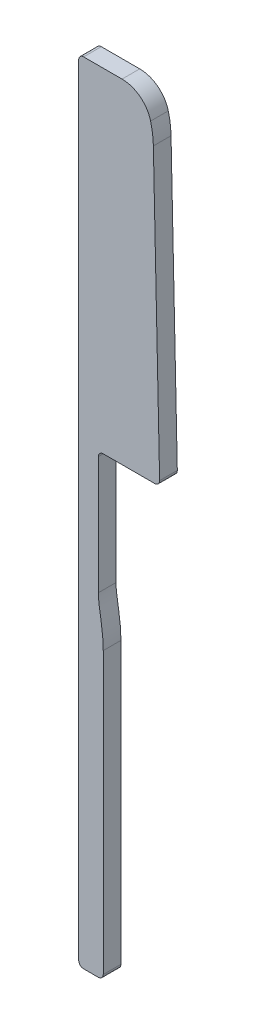
ISO-10303-21;
HEADER;
FILE_DESCRIPTION(('STEP AP214'),'2;1');
FILE_NAME('part.step','',(''),(''),'','','');
FILE_SCHEMA(('AUTOMOTIVE_DESIGN { 1 0 10303 214 1 1 1 1 }'));
ENDSEC;
DATA;
#1=APPLICATION_CONTEXT('core data for automotive mechanical design processes');
#2=APPLICATION_PROTOCOL_DEFINITION('international standard','automotive_design',2000,#1);
#3=PRODUCT_CONTEXT('',#1,'mechanical');
#4=PRODUCT('Part','Part','',(#3));
#5=PRODUCT_RELATED_PRODUCT_CATEGORY('part','',(#4));
#6=PRODUCT_DEFINITION_FORMATION('','',#4);
#7=PRODUCT_DEFINITION_CONTEXT('part definition',#1,'design');
#8=PRODUCT_DEFINITION('design','',#6,#7);
#9=PRODUCT_DEFINITION_SHAPE('','',#8);
#10=(LENGTH_UNIT() NAMED_UNIT(*) SI_UNIT(.MILLI.,.METRE.));
#11=(NAMED_UNIT(*) PLANE_ANGLE_UNIT() SI_UNIT($,.RADIAN.));
#12=(NAMED_UNIT(*) SI_UNIT($,.STERADIAN.) SOLID_ANGLE_UNIT());
#13=UNCERTAINTY_MEASURE_WITH_UNIT(LENGTH_MEASURE(1.E-05),#10,'distance_accuracy_value','');
#14=(GEOMETRIC_REPRESENTATION_CONTEXT(3) GLOBAL_UNCERTAINTY_ASSIGNED_CONTEXT((#13)) GLOBAL_UNIT_ASSIGNED_CONTEXT((#10,
#11,#12)) REPRESENTATION_CONTEXT('',''));
#15=CARTESIAN_POINT('',(0.,0.,0.));
#16=DIRECTION('',(0.,0.,1.));
#17=DIRECTION('',(1.,0.,0.));
#18=AXIS2_PLACEMENT_3D('',#15,#16,#17);
#19=CARTESIAN_POINT('',(14.4143233217841,80.5,1.8));
#20=DIRECTION('',(0.,0.,-1.));
#21=DIRECTION('',(-1.,0.,0.));
#22=AXIS2_PLACEMENT_3D('',#19,#20,#21);
#23=CYLINDRICAL_SURFACE('',#22,3.);
#24=DIRECTION('',(0.,0.,-1.));
#25=VECTOR('',#24,1.);
#26=CARTESIAN_POINT('',(17.3194338133368,81.2485539605604,1.8));
#27=LINE('',#26,#25);
#28=CARTESIAN_POINT('',(17.3194338133368,81.2485539605604,0.));
#29=VERTEX_POINT('',#28);
#30=CARTESIAN_POINT('',(17.3194338133368,81.2485539605604,1.8));
#31=VERTEX_POINT('',#30);
#32=EDGE_CURVE('E213',#29,#31,#27,.F.);
#33=ORIENTED_EDGE('',*,*,#32,.F.);
#34=CARTESIAN_POINT('',(14.4143233217841,80.5,0.));
#35=DIRECTION('',(0.,0.,-1.));
#36=DIRECTION('',(-1.,0.,0.));
#37=AXIS2_PLACEMENT_3D('',#34,#35,#36);
#38=CIRCLE('',#37,3.);
#39=CARTESIAN_POINT('',(14.4143233217841,83.5,0.));
#40=VERTEX_POINT('',#39);
#41=EDGE_CURVE('E45',#40,#29,#38,.T.);
#42=ORIENTED_EDGE('',*,*,#41,.F.);
#43=DIRECTION('',(0.,0.,-1.));
#44=VECTOR('',#43,1.);
#45=CARTESIAN_POINT('',(14.4143233217841,83.5,1.8));
#46=LINE('',#45,#44);
#47=CARTESIAN_POINT('',(14.4143233217841,83.5,1.8));
#48=VERTEX_POINT('',#47);
#49=EDGE_CURVE('E217',#48,#40,#46,.T.);
#50=ORIENTED_EDGE('',*,*,#49,.F.);
#51=CARTESIAN_POINT('',(14.4143233217841,80.5,1.8));
#52=DIRECTION('',(0.,0.,-1.));
#53=DIRECTION('',(-1.,0.,0.));
#54=AXIS2_PLACEMENT_3D('',#51,#52,#53);
#55=CIRCLE('',#54,3.);
#56=EDGE_CURVE('E11',#31,#48,#55,.F.);
#57=ORIENTED_EDGE('',*,*,#56,.F.);
#58=EDGE_LOOP('',(#33,#42,#50,#57));
#59=FACE_BOUND('',#58,.T.);
#60=ADVANCED_FACE('F38',(#59),#23,.T.);
#61=CARTESIAN_POINT('',(12.5,32.15,1.8));
#62=DIRECTION('',(-1.,0.,0.));
#63=DIRECTION('',(0.,-1.,0.));
#64=AXIS2_PLACEMENT_3D('',#61,#62,#63);
#65=PLANE('',#64);
#66=DIRECTION('',(0.,1.,0.));
#67=VECTOR('',#66,1.);
#68=CARTESIAN_POINT('',(12.5,32.15,1.8));
#69=LINE('',#68,#67);
#70=CARTESIAN_POINT('',(12.5,3.59,1.8));
#71=VERTEX_POINT('',#70);
#72=CARTESIAN_POINT('',(12.5,32.15,1.8));
#73=VERTEX_POINT('',#72);
#74=EDGE_CURVE('E139',#71,#73,#69,.T.);
#75=ORIENTED_EDGE('',*,*,#74,.F.);
#76=DIRECTION('',(0.,0.,1.));
#77=VECTOR('',#76,1.);
#78=CARTESIAN_POINT('',(12.5,3.59,0.));
#79=LINE('',#78,#77);
#80=CARTESIAN_POINT('',(12.5,3.59,0.));
#81=VERTEX_POINT('',#80);
#82=EDGE_CURVE('E278',#71,#81,#79,.F.);
#83=ORIENTED_EDGE('',*,*,#82,.T.);
#84=DIRECTION('',(0.,1.,0.));
#85=VECTOR('',#84,1.);
#86=CARTESIAN_POINT('',(12.5,32.15,0.));
#87=LINE('',#86,#85);
#88=CARTESIAN_POINT('',(12.5,32.15,0.));
#89=VERTEX_POINT('',#88);
#90=EDGE_CURVE('E156',#81,#89,#87,.T.);
#91=ORIENTED_EDGE('',*,*,#90,.T.);
#92=DIRECTION('',(0.,0.,-1.));
#93=VECTOR('',#92,1.);
#94=CARTESIAN_POINT('',(12.5,32.15,1.8));
#95=LINE('',#94,#93);
#96=EDGE_CURVE('E153',#73,#89,#95,.T.);
#97=ORIENTED_EDGE('',*,*,#96,.F.);
#98=EDGE_LOOP('',(#75,#83,#91,#97));
#99=FACE_BOUND('',#98,.T.);
#100=ADVANCED_FACE('F154',(#99),#65,.F.);
#101=CARTESIAN_POINT('',(9.61,12.5113444444444,1.8));
#102=DIRECTION('',(0.,0.,-1.));
#103=DIRECTION('',(-1.,0.,0.));
#104=AXIS2_PLACEMENT_3D('',#101,#102,#103);
#105=PLANE('',#104);
#106=CARTESIAN_POINT('',(8.60410233867879,79.0028920788793,1.8));
#107=DIRECTION('',(0.,0.,1.));
#108=DIRECTION('',(1.,0.,0.));
#109=AXIS2_PLACEMENT_3D('',#106,#107,#108);
#110=CIRCLE('',#109,9.00000000000001);
#111=CARTESIAN_POINT('',(17.601960582398,79.1992260441903,1.8));
#112=VERTEX_POINT('',#111);
#113=EDGE_CURVE('E293',#112,#31,#110,.T.);
#114=ORIENTED_EDGE('',*,*,#113,.T.);
#115=ORIENTED_EDGE('',*,*,#56,.T.);
#116=DIRECTION('',(-1.,0.,0.));
#117=VECTOR('',#116,1.);
#118=CARTESIAN_POINT('',(10.,83.5,1.8));
#119=LINE('',#118,#117);
#120=CARTESIAN_POINT('',(10.5,83.5,1.8));
#121=VERTEX_POINT('',#120);
#122=EDGE_CURVE('E292',#48,#121,#119,.T.);
#123=ORIENTED_EDGE('',*,*,#122,.T.);
#124=CARTESIAN_POINT('',(10.5,83.,1.8));
#125=DIRECTION('',(0.,0.,-1.));
#126=DIRECTION('',(-1.,0.,0.));
#127=AXIS2_PLACEMENT_3D('',#124,#125,#126);
#128=CIRCLE('',#127,0.5);
#129=CARTESIAN_POINT('',(10.,83.,1.8));
#130=VERTEX_POINT('',#129);
#131=EDGE_CURVE('E253',#121,#130,#128,.F.);
#132=ORIENTED_EDGE('',*,*,#131,.T.);
#133=DIRECTION('',(0.,-1.,0.));
#134=VECTOR('',#133,1.);
#135=CARTESIAN_POINT('',(10.,14.5,1.8));
#136=LINE('',#135,#134);
#137=CARTESIAN_POINT('',(10.,3.59,1.8));
#138=VERTEX_POINT('',#137);
#139=EDGE_CURVE('E239',#130,#138,#136,.T.);
#140=ORIENTED_EDGE('',*,*,#139,.T.);
#141=CARTESIAN_POINT('',(10.5,3.59,1.8));
#142=DIRECTION('',(0.,0.,-1.));
#143=DIRECTION('',(-1.,0.,0.));
#144=AXIS2_PLACEMENT_3D('',#141,#142,#143);
#145=CIRCLE('',#144,0.5);
#146=CARTESIAN_POINT('',(10.5,3.09,1.8));
#147=VERTEX_POINT('',#146);
#148=EDGE_CURVE('E275',#138,#147,#145,.F.);
#149=ORIENTED_EDGE('',*,*,#148,.T.);
#150=DIRECTION('',(-1.,0.,0.));
#151=VECTOR('',#150,1.);
#152=CARTESIAN_POINT('',(10.,3.09,1.8));
#153=LINE('',#152,#151);
#154=CARTESIAN_POINT('',(12.,3.09,1.8));
#155=VERTEX_POINT('',#154);
#156=EDGE_CURVE('E303',#155,#147,#153,.T.);
#157=ORIENTED_EDGE('',*,*,#156,.F.);
#158=CARTESIAN_POINT('',(12.,3.59,1.8));
#159=DIRECTION('',(0.,0.,-1.));
#160=DIRECTION('',(-1.,0.,0.));
#161=AXIS2_PLACEMENT_3D('',#158,#159,#160);
#162=CIRCLE('',#161,0.5);
#163=EDGE_CURVE('E147',#155,#71,#162,.F.);
#164=ORIENTED_EDGE('',*,*,#163,.T.);
#165=ORIENTED_EDGE('',*,*,#74,.T.);
#166=CARTESIAN_POINT('',(12.5,32.15,1.8));
#167=CARTESIAN_POINT('',(12.5,34.1534508074309,1.8));
#168=CARTESIAN_POINT('',(12.,35.7421929324208,1.8));
#169=CARTESIAN_POINT('',(12.,37.,1.8));
#170=B_SPLINE_CURVE_WITH_KNOTS('',3,(#166,#167,#168,#169),.UNSPECIFIED.,.F.,.F.,(4,4),(0.,1.),.UNSPECIFIED.);
#171=CARTESIAN_POINT('',(12.,37.,1.8));
#172=VERTEX_POINT('',#171);
#173=EDGE_CURVE('E144',#73,#172,#170,.T.);
#174=ORIENTED_EDGE('',*,*,#173,.T.);
#175=DIRECTION('',(0.,1.,0.));
#176=VECTOR('',#175,1.);
#177=CARTESIAN_POINT('',(12.,49.5,1.8));
#178=LINE('',#177,#176);
#179=CARTESIAN_POINT('',(12.,49.,1.8));
#180=VERTEX_POINT('',#179);
#181=EDGE_CURVE('E165',#172,#180,#178,.T.);
#182=ORIENTED_EDGE('',*,*,#181,.T.);
#183=CARTESIAN_POINT('',(12.5,49.,1.8));
#184=DIRECTION('',(0.,0.,-1.));
#185=DIRECTION('',(-1.,0.,0.));
#186=AXIS2_PLACEMENT_3D('',#183,#184,#185);
#187=CIRCLE('',#186,0.5);
#188=CARTESIAN_POINT('',(12.5,49.5,1.8));
#189=VERTEX_POINT('',#188);
#190=EDGE_CURVE('E267',#180,#189,#187,.T.);
#191=ORIENTED_EDGE('',*,*,#190,.T.);
#192=DIRECTION('',(1.,0.,0.));
#193=VECTOR('',#192,1.);
#194=CARTESIAN_POINT('',(18.25,49.5,1.8));
#195=LINE('',#194,#193);
#196=CARTESIAN_POINT('',(17.7389709464066,49.5,1.8));
#197=VERTEX_POINT('',#196);
#198=EDGE_CURVE('E167',#189,#197,#195,.T.);
#199=ORIENTED_EDGE('',*,*,#198,.T.);
#200=CARTESIAN_POINT('',(17.7389709464066,50.,1.8));
#201=DIRECTION('',(0.,0.,-1.));
#202=DIRECTION('',(-1.,0.,0.));
#203=AXIS2_PLACEMENT_3D('',#200,#201,#202);
#204=CIRCLE('',#203,0.5);
#205=CARTESIAN_POINT('',(18.2388519599465,50.0109074425173,1.8));
#206=VERTEX_POINT('',#205);
#207=EDGE_CURVE('E251',#197,#206,#204,.F.);
#208=ORIENTED_EDGE('',*,*,#207,.T.);
#209=DIRECTION('',(-0.0218148850345616,0.999762027079909,0.));
#210=VECTOR('',#209,1.);
#211=CARTESIAN_POINT('',(18.25,49.5,1.8));
#212=LINE('',#211,#210);
#213=EDGE_CURVE('E297',#206,#112,#212,.T.);
#214=ORIENTED_EDGE('',*,*,#213,.T.);
#215=EDGE_LOOP('',(#114,#115,#123,#132,#140,#149,#157,#164,#165,#174,#182,#191,#199,#208,#214));
#216=FACE_BOUND('',#215,.T.);
#217=ADVANCED_FACE('F141',(#216),#105,.F.);
#218=CARTESIAN_POINT('',(9.61,12.5113444444444,0.));
#219=DIRECTION('',(0.,0.,-1.));
#220=DIRECTION('',(-1.,0.,0.));
#221=AXIS2_PLACEMENT_3D('',#218,#219,#220);
#222=PLANE('',#221);
#223=DIRECTION('',(-1.,0.,0.));
#224=VECTOR('',#223,1.);
#225=CARTESIAN_POINT('',(10.,83.5,0.));
#226=LINE('',#225,#224);
#227=CARTESIAN_POINT('',(10.5,83.5,0.));
#228=VERTEX_POINT('',#227);
#229=EDGE_CURVE('E228',#40,#228,#226,.T.);
#230=ORIENTED_EDGE('',*,*,#229,.F.);
#231=ORIENTED_EDGE('',*,*,#41,.T.);
#232=CARTESIAN_POINT('',(8.60410233867879,79.0028920788793,0.));
#233=DIRECTION('',(0.,0.,1.));
#234=DIRECTION('',(1.,0.,0.));
#235=AXIS2_PLACEMENT_3D('',#232,#233,#234);
#236=CIRCLE('',#235,9.00000000000001);
#237=CARTESIAN_POINT('',(17.601960582398,79.1992260441903,0.));
#238=VERTEX_POINT('',#237);
#239=EDGE_CURVE('E222',#238,#29,#236,.T.);
#240=ORIENTED_EDGE('',*,*,#239,.F.);
#241=DIRECTION('',(-0.0218148850345616,0.999762027079909,0.));
#242=VECTOR('',#241,1.);
#243=CARTESIAN_POINT('',(18.25,49.5,0.));
#244=LINE('',#243,#242);
#245=CARTESIAN_POINT('',(18.2388519599465,50.0109074425173,0.));
#246=VERTEX_POINT('',#245);
#247=EDGE_CURVE('E229',#246,#238,#244,.T.);
#248=ORIENTED_EDGE('',*,*,#247,.F.);
#249=CARTESIAN_POINT('',(17.7389709464066,50.,0.));
#250=DIRECTION('',(0.,0.,-1.));
#251=DIRECTION('',(-1.,0.,0.));
#252=AXIS2_PLACEMENT_3D('',#249,#250,#251);
#253=CIRCLE('',#252,0.5);
#254=CARTESIAN_POINT('',(17.7389709464066,49.5,0.));
#255=VERTEX_POINT('',#254);
#256=EDGE_CURVE('E243',#246,#255,#253,.T.);
#257=ORIENTED_EDGE('',*,*,#256,.T.);
#258=DIRECTION('',(1.,0.,0.));
#259=VECTOR('',#258,1.);
#260=CARTESIAN_POINT('',(18.25,49.5,0.));
#261=LINE('',#260,#259);
#262=CARTESIAN_POINT('',(12.5,49.5,0.));
#263=VERTEX_POINT('',#262);
#264=EDGE_CURVE('E232',#263,#255,#261,.T.);
#265=ORIENTED_EDGE('',*,*,#264,.F.);
#266=CARTESIAN_POINT('',(12.5,49.,0.));
#267=DIRECTION('',(0.,0.,-1.));
#268=DIRECTION('',(-1.,0.,0.));
#269=AXIS2_PLACEMENT_3D('',#266,#267,#268);
#270=CIRCLE('',#269,0.5);
#271=CARTESIAN_POINT('',(12.,49.,0.));
#272=VERTEX_POINT('',#271);
#273=EDGE_CURVE('E265',#263,#272,#270,.F.);
#274=ORIENTED_EDGE('',*,*,#273,.T.);
#275=DIRECTION('',(0.,1.,0.));
#276=VECTOR('',#275,1.);
#277=CARTESIAN_POINT('',(12.,49.5,0.));
#278=LINE('',#277,#276);
#279=CARTESIAN_POINT('',(12.,37.,0.));
#280=VERTEX_POINT('',#279);
#281=EDGE_CURVE('E307',#280,#272,#278,.T.);
#282=ORIENTED_EDGE('',*,*,#281,.F.);
#283=CARTESIAN_POINT('',(12.5,32.15,0.));
#284=CARTESIAN_POINT('',(12.5,34.1534508074309,0.));
#285=CARTESIAN_POINT('',(12.,35.7421929324208,0.));
#286=CARTESIAN_POINT('',(12.,37.,0.));
#287=B_SPLINE_CURVE_WITH_KNOTS('',3,(#283,#284,#285,#286),.UNSPECIFIED.,.F.,.F.,(4,4),(0.,1.),.UNSPECIFIED.);
#288=EDGE_CURVE('E302',#89,#280,#287,.T.);
#289=ORIENTED_EDGE('',*,*,#288,.F.);
#290=ORIENTED_EDGE('',*,*,#90,.F.);
#291=CARTESIAN_POINT('',(12.,3.59,0.));
#292=DIRECTION('',(0.,0.,-1.));
#293=DIRECTION('',(-1.,0.,0.));
#294=AXIS2_PLACEMENT_3D('',#291,#292,#293);
#295=CIRCLE('',#294,0.5);
#296=CARTESIAN_POINT('',(12.,3.09,0.));
#297=VERTEX_POINT('',#296);
#298=EDGE_CURVE('E282',#81,#297,#295,.T.);
#299=ORIENTED_EDGE('',*,*,#298,.T.);
#300=DIRECTION('',(-1.,0.,0.));
#301=VECTOR('',#300,1.);
#302=CARTESIAN_POINT('',(10.,3.09,0.));
#303=LINE('',#302,#301);
#304=CARTESIAN_POINT('',(10.5,3.09,0.));
#305=VERTEX_POINT('',#304);
#306=EDGE_CURVE('E348',#297,#305,#303,.T.);
#307=ORIENTED_EDGE('',*,*,#306,.T.);
#308=CARTESIAN_POINT('',(10.5,3.59,0.));
#309=DIRECTION('',(0.,0.,-1.));
#310=DIRECTION('',(-1.,0.,0.));
#311=AXIS2_PLACEMENT_3D('',#308,#309,#310);
#312=CIRCLE('',#311,0.5);
#313=CARTESIAN_POINT('',(10.,3.59,0.));
#314=VERTEX_POINT('',#313);
#315=EDGE_CURVE('E280',#305,#314,#312,.T.);
#316=ORIENTED_EDGE('',*,*,#315,.T.);
#317=DIRECTION('',(0.,-1.,0.));
#318=VECTOR('',#317,1.);
#319=CARTESIAN_POINT('',(10.,14.5,0.));
#320=LINE('',#319,#318);
#321=CARTESIAN_POINT('',(10.,83.,0.));
#322=VERTEX_POINT('',#321);
#323=EDGE_CURVE('E150',#322,#314,#320,.T.);
#324=ORIENTED_EDGE('',*,*,#323,.F.);
#325=CARTESIAN_POINT('',(10.5,83.,0.));
#326=DIRECTION('',(0.,0.,-1.));
#327=DIRECTION('',(-1.,0.,0.));
#328=AXIS2_PLACEMENT_3D('',#325,#326,#327);
#329=CIRCLE('',#328,0.5);
#330=EDGE_CURVE('E245',#322,#228,#329,.T.);
#331=ORIENTED_EDGE('',*,*,#330,.T.);
#332=EDGE_LOOP('',(#230,#231,#240,#248,#257,#265,#274,#282,#289,#290,#299,#307,#316,#324,#331));
#333=FACE_BOUND('',#332,.T.);
#334=ADVANCED_FACE('F182',(#333),#222,.T.);
#335=DIRECTION('',(0.,0.,-1.));
#336=VECTOR('',#335,1.);
#337=SURFACE_OF_LINEAR_EXTRUSION('',#170,#336);
#338=ORIENTED_EDGE('',*,*,#288,.T.);
#339=DIRECTION('',(0.,0.,-1.));
#340=VECTOR('',#339,1.);
#341=CARTESIAN_POINT('',(12.,37.,1.8));
#342=LINE('',#341,#340);
#343=EDGE_CURVE('E160',#172,#280,#342,.T.);
#344=ORIENTED_EDGE('',*,*,#343,.F.);
#345=ORIENTED_EDGE('',*,*,#173,.F.);
#346=ORIENTED_EDGE('',*,*,#96,.T.);
#347=EDGE_LOOP('',(#338,#344,#345,#346));
#348=FACE_BOUND('',#347,.T.);
#349=ADVANCED_FACE('F162',(#348),#337,.F.);
#350=CARTESIAN_POINT('',(12.,49.5,1.8));
#351=DIRECTION('',(-1.,0.,0.));
#352=DIRECTION('',(0.,-1.,0.));
#353=AXIS2_PLACEMENT_3D('',#350,#351,#352);
#354=PLANE('',#353);
#355=ORIENTED_EDGE('',*,*,#281,.T.);
#356=DIRECTION('',(0.,0.,-1.));
#357=VECTOR('',#356,1.);
#358=CARTESIAN_POINT('',(12.,49.,1.8));
#359=LINE('',#358,#357);
#360=EDGE_CURVE('E260',#272,#180,#359,.F.);
#361=ORIENTED_EDGE('',*,*,#360,.T.);
#362=ORIENTED_EDGE('',*,*,#181,.F.);
#363=ORIENTED_EDGE('',*,*,#343,.T.);
#364=EDGE_LOOP('',(#355,#361,#362,#363));
#365=FACE_BOUND('',#364,.T.);
#366=ADVANCED_FACE('F181',(#365),#354,.F.);
#367=CARTESIAN_POINT('',(18.25,49.5,1.8));
#368=DIRECTION('',(0.,1.,0.));
#369=DIRECTION('',(0.,0.,1.));
#370=AXIS2_PLACEMENT_3D('',#367,#368,#369);
#371=PLANE('',#370);
#372=ORIENTED_EDGE('',*,*,#198,.F.);
#373=DIRECTION('',(0.,0.,-1.));
#374=VECTOR('',#373,1.);
#375=CARTESIAN_POINT('',(12.5,49.5,0.));
#376=LINE('',#375,#374);
#377=EDGE_CURVE('E257',#189,#263,#376,.T.);
#378=ORIENTED_EDGE('',*,*,#377,.T.);
#379=ORIENTED_EDGE('',*,*,#264,.T.);
#380=DIRECTION('',(0.,0.,-1.));
#381=VECTOR('',#380,1.);
#382=CARTESIAN_POINT('',(17.7389709464066,49.5,1.8));
#383=LINE('',#382,#381);
#384=EDGE_CURVE('E255',#255,#197,#383,.F.);
#385=ORIENTED_EDGE('',*,*,#384,.T.);
#386=EDGE_LOOP('',(#372,#378,#379,#385));
#387=FACE_BOUND('',#386,.T.);
#388=ADVANCED_FACE('F317',(#387),#371,.F.);
#389=CARTESIAN_POINT('',(18.25,49.5,1.8));
#390=DIRECTION('',(-0.999762027079909,-0.0218148850345616,0.));
#391=DIRECTION('',(0.0218148850345616,-0.999762027079909,0.));
#392=AXIS2_PLACEMENT_3D('',#389,#390,#391);
#393=PLANE('',#392);
#394=ORIENTED_EDGE('',*,*,#213,.F.);
#395=DIRECTION('',(0.,0.,-1.));
#396=VECTOR('',#395,1.);
#397=CARTESIAN_POINT('',(18.2388519599465,50.0109074425173,1.8));
#398=LINE('',#397,#396);
#399=EDGE_CURVE('E262',#206,#246,#398,.T.);
#400=ORIENTED_EDGE('',*,*,#399,.T.);
#401=ORIENTED_EDGE('',*,*,#247,.T.);
#402=DIRECTION('',(0.,0.,-1.));
#403=VECTOR('',#402,1.);
#404=CARTESIAN_POINT('',(17.601960582398,79.1992260441903,1.8));
#405=LINE('',#404,#403);
#406=EDGE_CURVE('E225',#112,#238,#405,.T.);
#407=ORIENTED_EDGE('',*,*,#406,.F.);
#408=EDGE_LOOP('',(#394,#400,#401,#407));
#409=FACE_BOUND('',#408,.T.);
#410=ADVANCED_FACE('F324',(#409),#393,.F.);
#411=CARTESIAN_POINT('',(8.60410233867879,79.0028920788793,1.8));
#412=DIRECTION('',(0.,0.,-1.));
#413=DIRECTION('',(-1.,0.,0.));
#414=AXIS2_PLACEMENT_3D('',#411,#412,#413);
#415=CYLINDRICAL_SURFACE('',#414,9.00000000000001);
#416=ORIENTED_EDGE('',*,*,#239,.T.);
#417=ORIENTED_EDGE('',*,*,#32,.T.);
#418=ORIENTED_EDGE('',*,*,#113,.F.);
#419=ORIENTED_EDGE('',*,*,#406,.T.);
#420=EDGE_LOOP('',(#416,#417,#418,#419));
#421=FACE_BOUND('',#420,.T.);
#422=ADVANCED_FACE('F223',(#421),#415,.T.);
#423=CARTESIAN_POINT('',(10.,83.5,1.8));
#424=DIRECTION('',(0.,-1.,0.));
#425=DIRECTION('',(0.,0.,-1.));
#426=AXIS2_PLACEMENT_3D('',#423,#424,#425);
#427=PLANE('',#426);
#428=ORIENTED_EDGE('',*,*,#122,.F.);
#429=ORIENTED_EDGE('',*,*,#49,.T.);
#430=ORIENTED_EDGE('',*,*,#229,.T.);
#431=DIRECTION('',(0.,0.,-1.));
#432=VECTOR('',#431,1.);
#433=CARTESIAN_POINT('',(10.5,83.5,1.8));
#434=LINE('',#433,#432);
#435=EDGE_CURVE('E248',#228,#121,#434,.F.);
#436=ORIENTED_EDGE('',*,*,#435,.T.);
#437=EDGE_LOOP('',(#428,#429,#430,#436));
#438=FACE_BOUND('',#437,.T.);
#439=ADVANCED_FACE('F290',(#438),#427,.F.);
#440=CARTESIAN_POINT('',(10.,14.5,1.8));
#441=DIRECTION('',(1.,0.,0.));
#442=DIRECTION('',(0.,0.,-1.));
#443=AXIS2_PLACEMENT_3D('',#440,#441,#442);
#444=PLANE('',#443);
#445=ORIENTED_EDGE('',*,*,#323,.T.);
#446=DIRECTION('',(0.,0.,-1.));
#447=VECTOR('',#446,1.);
#448=CARTESIAN_POINT('',(10.,3.59,1.8));
#449=LINE('',#448,#447);
#450=EDGE_CURVE('E218',#314,#138,#449,.F.);
#451=ORIENTED_EDGE('',*,*,#450,.T.);
#452=ORIENTED_EDGE('',*,*,#139,.F.);
#453=DIRECTION('',(0.,0.,-1.));
#454=VECTOR('',#453,1.);
#455=CARTESIAN_POINT('',(10.,83.,1.8));
#456=LINE('',#455,#454);
#457=EDGE_CURVE('E159',#130,#322,#456,.T.);
#458=ORIENTED_EDGE('',*,*,#457,.T.);
#459=EDGE_LOOP('',(#445,#451,#452,#458));
#460=FACE_BOUND('',#459,.T.);
#461=ADVANCED_FACE('F190',(#460),#444,.F.);
#462=CARTESIAN_POINT('',(10.5,83.,1.8));
#463=DIRECTION('',(0.,0.,-1.));
#464=DIRECTION('',(-1.,0.,0.));
#465=AXIS2_PLACEMENT_3D('',#462,#463,#464);
#466=CYLINDRICAL_SURFACE('',#465,0.5);
#467=ORIENTED_EDGE('',*,*,#131,.F.);
#468=ORIENTED_EDGE('',*,*,#435,.F.);
#469=ORIENTED_EDGE('',*,*,#330,.F.);
#470=ORIENTED_EDGE('',*,*,#457,.F.);
#471=EDGE_LOOP('',(#467,#468,#469,#470));
#472=FACE_BOUND('',#471,.T.);
#473=ADVANCED_FACE('F186',(#472),#466,.T.);
#474=CARTESIAN_POINT('',(12.5,49.,1.8));
#475=DIRECTION('',(0.,0.,1.));
#476=DIRECTION('',(1.,0.,0.));
#477=AXIS2_PLACEMENT_3D('',#474,#475,#476);
#478=CYLINDRICAL_SURFACE('',#477,0.5);
#479=ORIENTED_EDGE('',*,*,#190,.F.);
#480=ORIENTED_EDGE('',*,*,#360,.F.);
#481=ORIENTED_EDGE('',*,*,#273,.F.);
#482=ORIENTED_EDGE('',*,*,#377,.F.);
#483=EDGE_LOOP('',(#479,#480,#481,#482));
#484=FACE_BOUND('',#483,.T.);
#485=ADVANCED_FACE('F189',(#484),#478,.F.);
#486=CARTESIAN_POINT('',(17.7389709464066,50.,1.8));
#487=DIRECTION('',(0.,0.,-1.));
#488=DIRECTION('',(-1.,0.,0.));
#489=AXIS2_PLACEMENT_3D('',#486,#487,#488);
#490=CYLINDRICAL_SURFACE('',#489,0.5);
#491=ORIENTED_EDGE('',*,*,#207,.F.);
#492=ORIENTED_EDGE('',*,*,#384,.F.);
#493=ORIENTED_EDGE('',*,*,#256,.F.);
#494=ORIENTED_EDGE('',*,*,#399,.F.);
#495=EDGE_LOOP('',(#491,#492,#493,#494));
#496=FACE_BOUND('',#495,.T.);
#497=ADVANCED_FACE('F194',(#496),#490,.T.);
#498=CARTESIAN_POINT('',(10.,3.09,1.8));
#499=DIRECTION('',(0.,-1.,0.));
#500=DIRECTION('',(0.,0.,-1.));
#501=AXIS2_PLACEMENT_3D('',#498,#499,#500);
#502=PLANE('',#501);
#503=ORIENTED_EDGE('',*,*,#306,.F.);
#504=DIRECTION('',(0.,0.,1.));
#505=VECTOR('',#504,1.);
#506=CARTESIAN_POINT('',(12.,3.09,1.8));
#507=LINE('',#506,#505);
#508=EDGE_CURVE('E272',#297,#155,#507,.T.);
#509=ORIENTED_EDGE('',*,*,#508,.T.);
#510=ORIENTED_EDGE('',*,*,#156,.T.);
#511=DIRECTION('',(0.,0.,-1.));
#512=VECTOR('',#511,1.);
#513=CARTESIAN_POINT('',(10.5,3.09,0.));
#514=LINE('',#513,#512);
#515=EDGE_CURVE('E269',#147,#305,#514,.T.);
#516=ORIENTED_EDGE('',*,*,#515,.T.);
#517=EDGE_LOOP('',(#503,#509,#510,#516));
#518=FACE_BOUND('',#517,.T.);
#519=ADVANCED_FACE('F198',(#518),#502,.T.);
#520=CARTESIAN_POINT('',(12.,3.59,1.8));
#521=DIRECTION('',(0.,0.,-1.));
#522=DIRECTION('',(-1.,0.,0.));
#523=AXIS2_PLACEMENT_3D('',#520,#521,#522);
#524=CYLINDRICAL_SURFACE('',#523,0.5);
#525=ORIENTED_EDGE('',*,*,#298,.F.);
#526=ORIENTED_EDGE('',*,*,#82,.F.);
#527=ORIENTED_EDGE('',*,*,#163,.F.);
#528=ORIENTED_EDGE('',*,*,#508,.F.);
#529=EDGE_LOOP('',(#525,#526,#527,#528));
#530=FACE_BOUND('',#529,.T.);
#531=ADVANCED_FACE('F200',(#530),#524,.T.);
#532=CARTESIAN_POINT('',(10.5,3.59,1.8));
#533=DIRECTION('',(0.,0.,1.));
#534=DIRECTION('',(1.,0.,0.));
#535=AXIS2_PLACEMENT_3D('',#532,#533,#534);
#536=CYLINDRICAL_SURFACE('',#535,0.5);
#537=ORIENTED_EDGE('',*,*,#148,.F.);
#538=ORIENTED_EDGE('',*,*,#450,.F.);
#539=ORIENTED_EDGE('',*,*,#315,.F.);
#540=ORIENTED_EDGE('',*,*,#515,.F.);
#541=EDGE_LOOP('',(#537,#538,#539,#540));
#542=FACE_BOUND('',#541,.T.);
#543=ADVANCED_FACE('F202',(#542),#536,.T.);
#544=CLOSED_SHELL('',(#60,#100,#217,#334,#349,#366,#388,#410,#422,#439,#461,#473,#485,#497,#519,
#531,#543));
#545=MANIFOLD_SOLID_BREP('B2',#544);
#546=ADVANCED_BREP_SHAPE_REPRESENTATION('',(#18,#545),#14);
#547=SHAPE_DEFINITION_REPRESENTATION(#9,#546);
ENDSEC;
END-ISO-10303-21;
